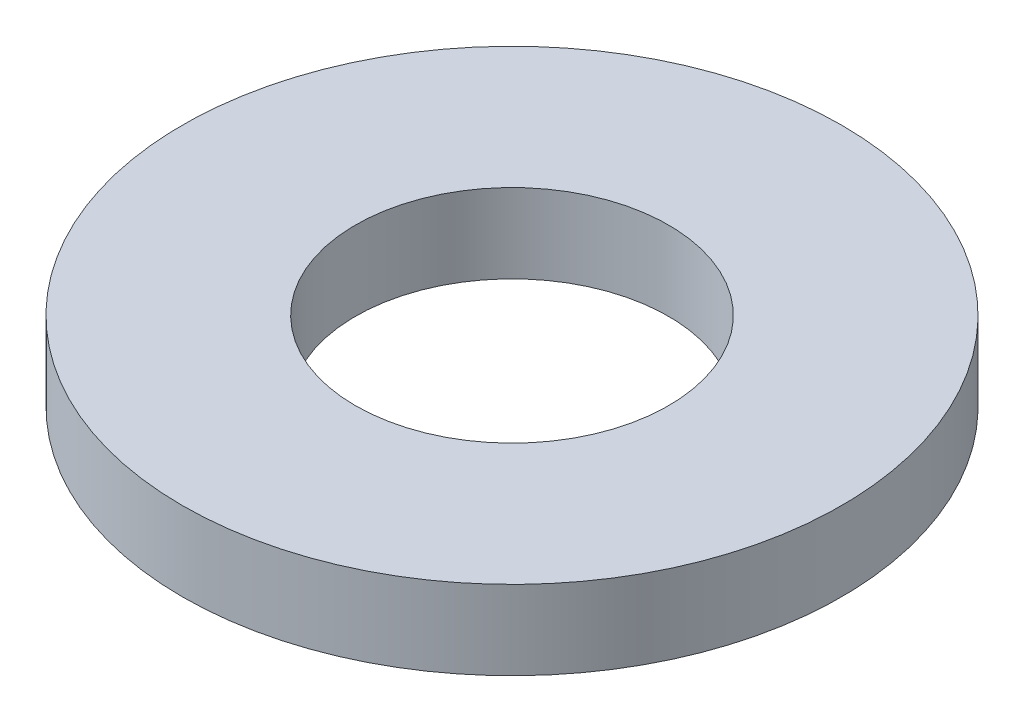
ISO-10303-21;
HEADER;
FILE_DESCRIPTION(('STEP AP214'),'2;1');
FILE_NAME('part.step','',(''),(''),'','','');
FILE_SCHEMA(('AUTOMOTIVE_DESIGN { 1 0 10303 214 1 1 1 1 }'));
ENDSEC;
DATA;
#1=APPLICATION_CONTEXT('core data for automotive mechanical design processes');
#2=APPLICATION_PROTOCOL_DEFINITION('international standard','automotive_design',2000,#1);
#3=PRODUCT_CONTEXT('',#1,'mechanical');
#4=PRODUCT('Part','Part','',(#3));
#5=PRODUCT_RELATED_PRODUCT_CATEGORY('part','',(#4));
#6=PRODUCT_DEFINITION_FORMATION('','',#4);
#7=PRODUCT_DEFINITION_CONTEXT('part definition',#1,'design');
#8=PRODUCT_DEFINITION('design','',#6,#7);
#9=PRODUCT_DEFINITION_SHAPE('','',#8);
#10=(LENGTH_UNIT() NAMED_UNIT(*) SI_UNIT(.MILLI.,.METRE.));
#11=(NAMED_UNIT(*) PLANE_ANGLE_UNIT() SI_UNIT($,.RADIAN.));
#12=(NAMED_UNIT(*) SI_UNIT($,.STERADIAN.) SOLID_ANGLE_UNIT());
#13=UNCERTAINTY_MEASURE_WITH_UNIT(LENGTH_MEASURE(1.E-05),#10,'distance_accuracy_value','');
#14=(GEOMETRIC_REPRESENTATION_CONTEXT(3) GLOBAL_UNCERTAINTY_ASSIGNED_CONTEXT((#13)) GLOBAL_UNIT_ASSIGNED_CONTEXT((#10,
#11,#12)) REPRESENTATION_CONTEXT('',''));
#15=CARTESIAN_POINT('',(0.,0.,0.));
#16=DIRECTION('',(0.,0.,1.));
#17=DIRECTION('',(1.,0.,0.));
#18=AXIS2_PLACEMENT_3D('',#15,#16,#17);
#19=CARTESIAN_POINT('',(0.,24.,0.));
#20=DIRECTION('',(0.,-1.,0.));
#21=DIRECTION('',(0.,0.,-1.));
#22=AXIS2_PLACEMENT_3D('',#19,#20,#21);
#23=CYLINDRICAL_SURFACE('',#22,100.);
#24=CARTESIAN_POINT('',(0.,24.,0.));
#25=DIRECTION('',(0.,1.,0.));
#26=DIRECTION('',(0.,0.,1.));
#27=AXIS2_PLACEMENT_3D('',#24,#25,#26);
#28=CIRCLE('',#27,100.);
#29=CARTESIAN_POINT('',(0.,24.,100.));
#30=VERTEX_POINT('',#29);
#31=EDGE_CURVE('E10',#30,#30,#28,.T.);
#32=ORIENTED_EDGE('',*,*,#31,.F.);
#33=EDGE_LOOP('',(#32));
#34=FACE_BOUND('',#33,.T.);
#35=CARTESIAN_POINT('',(0.,0.,0.));
#36=DIRECTION('',(0.,1.,0.));
#37=DIRECTION('',(0.,0.,1.));
#38=AXIS2_PLACEMENT_3D('',#35,#36,#37);
#39=CIRCLE('',#38,100.);
#40=CARTESIAN_POINT('',(0.,0.,100.));
#41=VERTEX_POINT('',#40);
#42=EDGE_CURVE('E37',#41,#41,#39,.T.);
#43=ORIENTED_EDGE('',*,*,#42,.T.);
#44=EDGE_LOOP('',(#43));
#45=FACE_BOUND('',#44,.T.);
#46=ADVANCED_FACE('F40',(#34,#45),#23,.T.);
#47=CARTESIAN_POINT('',(0.,24.,0.));
#48=DIRECTION('',(0.,1.,0.));
#49=DIRECTION('',(0.,0.,1.));
#50=AXIS2_PLACEMENT_3D('',#47,#48,#49);
#51=PLANE('',#50);
#52=CARTESIAN_POINT('',(0.,24.,0.));
#53=DIRECTION('',(0.,1.,0.));
#54=DIRECTION('',(0.,0.,1.));
#55=AXIS2_PLACEMENT_3D('',#52,#53,#54);
#56=CIRCLE('',#55,47.5);
#57=CARTESIAN_POINT('',(0.,24.,47.5));
#58=VERTEX_POINT('',#57);
#59=EDGE_CURVE('E50',#58,#58,#56,.T.);
#60=ORIENTED_EDGE('',*,*,#59,.F.);
#61=EDGE_LOOP('',(#60));
#62=FACE_BOUND('',#61,.T.);
#63=ORIENTED_EDGE('',*,*,#31,.T.);
#64=EDGE_LOOP('',(#63));
#65=FACE_BOUND('',#64,.T.);
#66=ADVANCED_FACE('F59',(#62,#65),#51,.T.);
#67=CARTESIAN_POINT('',(0.,0.,0.));
#68=DIRECTION('',(0.,1.,0.));
#69=DIRECTION('',(0.,0.,1.));
#70=AXIS2_PLACEMENT_3D('',#67,#68,#69);
#71=PLANE('',#70);
#72=CARTESIAN_POINT('',(0.,0.,0.));
#73=DIRECTION('',(0.,1.,0.));
#74=DIRECTION('',(0.,0.,1.));
#75=AXIS2_PLACEMENT_3D('',#72,#73,#74);
#76=CIRCLE('',#75,47.5);
#77=CARTESIAN_POINT('',(0.,0.,47.5));
#78=VERTEX_POINT('',#77);
#79=EDGE_CURVE('E47',#78,#78,#76,.T.);
#80=ORIENTED_EDGE('',*,*,#79,.T.);
#81=EDGE_LOOP('',(#80));
#82=FACE_BOUND('',#81,.T.);
#83=ORIENTED_EDGE('',*,*,#42,.F.);
#84=EDGE_LOOP('',(#83));
#85=FACE_BOUND('',#84,.T.);
#86=ADVANCED_FACE('F58',(#82,#85),#71,.F.);
#87=CARTESIAN_POINT('',(0.,24.,0.));
#88=DIRECTION('',(0.,-1.,0.));
#89=DIRECTION('',(0.,0.,-1.));
#90=AXIS2_PLACEMENT_3D('',#87,#88,#89);
#91=CYLINDRICAL_SURFACE('',#90,47.5);
#92=ORIENTED_EDGE('',*,*,#59,.T.);
#93=EDGE_LOOP('',(#92));
#94=FACE_BOUND('',#93,.T.);
#95=ORIENTED_EDGE('',*,*,#79,.F.);
#96=EDGE_LOOP('',(#95));
#97=FACE_BOUND('',#96,.T.);
#98=ADVANCED_FACE('F54',(#94,#97),#91,.F.);
#99=CLOSED_SHELL('',(#46,#66,#86,#98));
#100=MANIFOLD_SOLID_BREP('B2',#99);
#101=ADVANCED_BREP_SHAPE_REPRESENTATION('',(#18,#100),#14);
#102=SHAPE_DEFINITION_REPRESENTATION(#9,#101);
ENDSEC;
END-ISO-10303-21;
